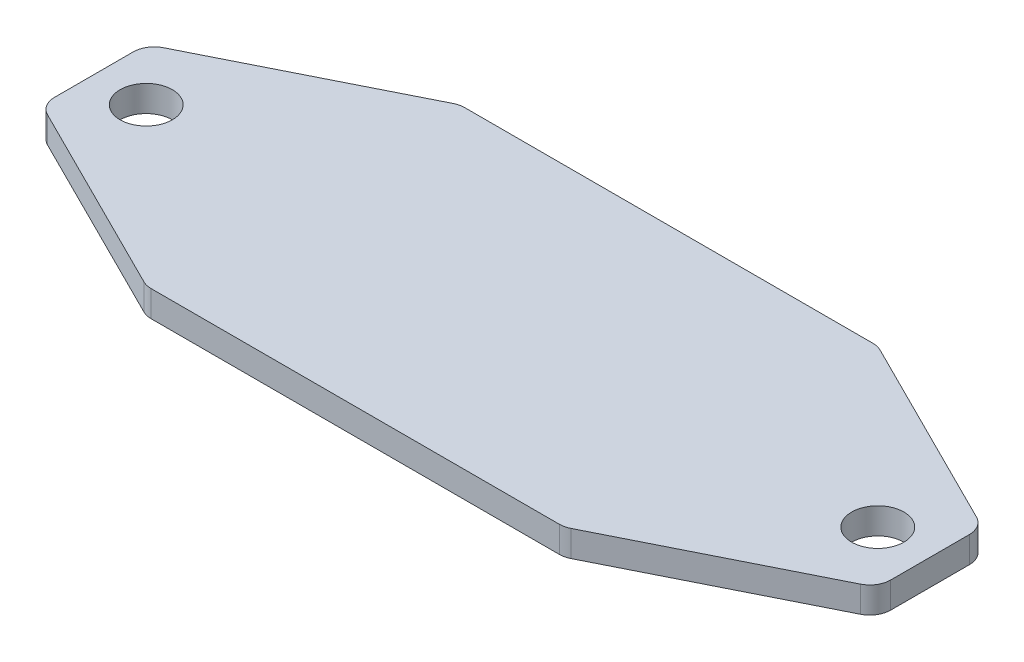
ISO-10303-21;
HEADER;
FILE_DESCRIPTION(('STEP AP214'),'2;1');
FILE_NAME('part.step','',(''),(''),'','','');
FILE_SCHEMA(('AUTOMOTIVE_DESIGN { 1 0 10303 214 1 1 1 1 }'));
ENDSEC;
DATA;
#1=APPLICATION_CONTEXT('core data for automotive mechanical design processes');
#2=APPLICATION_PROTOCOL_DEFINITION('international standard','automotive_design',2000,#1);
#3=PRODUCT_CONTEXT('',#1,'mechanical');
#4=PRODUCT('Part','Part','',(#3));
#5=PRODUCT_RELATED_PRODUCT_CATEGORY('part','',(#4));
#6=PRODUCT_DEFINITION_FORMATION('','',#4);
#7=PRODUCT_DEFINITION_CONTEXT('part definition',#1,'design');
#8=PRODUCT_DEFINITION('design','',#6,#7);
#9=PRODUCT_DEFINITION_SHAPE('','',#8);
#10=(LENGTH_UNIT() NAMED_UNIT(*) SI_UNIT(.MILLI.,.METRE.));
#11=(NAMED_UNIT(*) PLANE_ANGLE_UNIT() SI_UNIT($,.RADIAN.));
#12=(NAMED_UNIT(*) SI_UNIT($,.STERADIAN.) SOLID_ANGLE_UNIT());
#13=UNCERTAINTY_MEASURE_WITH_UNIT(LENGTH_MEASURE(1.E-05),#10,'distance_accuracy_value','');
#14=(GEOMETRIC_REPRESENTATION_CONTEXT(3) GLOBAL_UNCERTAINTY_ASSIGNED_CONTEXT((#13)) GLOBAL_UNIT_ASSIGNED_CONTEXT((#10,
#11,#12)) REPRESENTATION_CONTEXT('',''));
#15=CARTESIAN_POINT('',(0.,0.,0.));
#16=DIRECTION('',(0.,0.,1.));
#17=DIRECTION('',(1.,0.,0.));
#18=AXIS2_PLACEMENT_3D('',#15,#16,#17);
#19=CARTESIAN_POINT('',(64.6985002136231,0.,4.78019366857527));
#20=DIRECTION('',(0.,1.,0.));
#21=DIRECTION('',(0.,0.,1.));
#22=AXIS2_PLACEMENT_3D('',#19,#20,#21);
#23=CYLINDRICAL_SURFACE('',#22,2.53999999999998);
#24=CARTESIAN_POINT('',(64.6985002136231,3.175,4.78019366857527));
#25=DIRECTION('',(0.,1.,0.));
#26=DIRECTION('',(0.,0.,1.));
#27=AXIS2_PLACEMENT_3D('',#24,#25,#26);
#28=CIRCLE('',#27,2.53999999999998);
#29=CARTESIAN_POINT('',(65.8344227461929,3.175,7.05203873371506));
#30=VERTEX_POINT('',#29);
#31=CARTESIAN_POINT('',(67.2385002136231,3.175,4.78019366857527));
#32=VERTEX_POINT('',#31);
#33=EDGE_CURVE('E194',#30,#32,#28,.T.);
#34=ORIENTED_EDGE('',*,*,#33,.F.);
#35=DIRECTION('',(0.,1.,0.));
#36=VECTOR('',#35,1.);
#37=CARTESIAN_POINT('',(65.8344227461929,0.,7.05203873371506));
#38=LINE('',#37,#36);
#39=CARTESIAN_POINT('',(65.8344227461929,0.,7.05203873371506));
#40=VERTEX_POINT('',#39);
#41=EDGE_CURVE('E11',#40,#30,#38,.T.);
#42=ORIENTED_EDGE('',*,*,#41,.F.);
#43=CARTESIAN_POINT('',(64.6985002136231,0.,4.78019366857527));
#44=DIRECTION('',(0.,1.,0.));
#45=DIRECTION('',(0.,0.,1.));
#46=AXIS2_PLACEMENT_3D('',#43,#44,#45);
#47=CIRCLE('',#46,2.53999999999998);
#48=CARTESIAN_POINT('',(67.2385002136231,0.,4.78019366857527));
#49=VERTEX_POINT('',#48);
#50=EDGE_CURVE('E255',#40,#49,#47,.T.);
#51=ORIENTED_EDGE('',*,*,#50,.T.);
#52=DIRECTION('',(0.,1.,0.));
#53=VECTOR('',#52,1.);
#54=CARTESIAN_POINT('',(67.2385002136231,0.,4.78019366857527));
#55=LINE('',#54,#53);
#56=EDGE_CURVE('E46',#49,#32,#55,.T.);
#57=ORIENTED_EDGE('',*,*,#56,.T.);
#58=EDGE_LOOP('',(#34,#42,#51,#57));
#59=FACE_BOUND('',#58,.T.);
#60=ADVANCED_FACE('F43',(#59),#23,.T.);
#61=CARTESIAN_POINT('',(42.3748100833434,0.,18.7818450651398));
#62=DIRECTION('',(0.447213595499958,0.,0.894427190999916));
#63=DIRECTION('',(0.894427190999916,0.,-0.447213595499958));
#64=AXIS2_PLACEMENT_3D('',#61,#62,#63);
#65=PLANE('',#64);
#66=DIRECTION('',(0.894427190999916,0.,-0.447213595499958));
#67=VECTOR('',#66,1.);
#68=CARTESIAN_POINT('',(42.3748100833434,3.175,18.7818450651398));
#69=LINE('',#68,#67);
#70=CARTESIAN_POINT('',(42.3748100833434,3.175,18.7818450651398));
#71=VERTEX_POINT('',#70);
#72=EDGE_CURVE('E252',#71,#30,#69,.T.);
#73=ORIENTED_EDGE('',*,*,#72,.F.);
#74=DIRECTION('',(0.,1.,0.));
#75=VECTOR('',#74,1.);
#76=CARTESIAN_POINT('',(42.3748100833434,0.,18.7818450651398));
#77=LINE('',#76,#75);
#78=CARTESIAN_POINT('',(42.3748100833434,0.,18.7818450651398));
#79=VERTEX_POINT('',#78);
#80=EDGE_CURVE('E53',#79,#71,#77,.T.);
#81=ORIENTED_EDGE('',*,*,#80,.F.);
#82=DIRECTION('',(0.894427190999916,0.,-0.447213595499958));
#83=VECTOR('',#82,1.);
#84=CARTESIAN_POINT('',(42.3748100833434,0.,18.7818450651398));
#85=LINE('',#84,#83);
#86=EDGE_CURVE('E180',#79,#40,#85,.T.);
#87=ORIENTED_EDGE('',*,*,#86,.T.);
#88=ORIENTED_EDGE('',*,*,#41,.T.);
#89=EDGE_LOOP('',(#73,#81,#87,#88));
#90=FACE_BOUND('',#89,.T.);
#91=ADVANCED_FACE('F297',(#90),#65,.T.);
#92=CARTESIAN_POINT('',(41.2388875507736,0.,16.51));
#93=DIRECTION('',(0.,1.,0.));
#94=DIRECTION('',(0.,0.,1.));
#95=AXIS2_PLACEMENT_3D('',#92,#93,#94);
#96=CYLINDRICAL_SURFACE('',#95,2.54);
#97=CARTESIAN_POINT('',(41.2388875507736,3.175,16.51));
#98=DIRECTION('',(0.,1.,0.));
#99=DIRECTION('',(0.,0.,1.));
#100=AXIS2_PLACEMENT_3D('',#97,#98,#99);
#101=CIRCLE('',#100,2.54);
#102=CARTESIAN_POINT('',(41.2388875507736,3.175,19.05));
#103=VERTEX_POINT('',#102);
#104=EDGE_CURVE('E166',#103,#71,#101,.T.);
#105=ORIENTED_EDGE('',*,*,#104,.F.);
#106=DIRECTION('',(0.,1.,0.));
#107=VECTOR('',#106,1.);
#108=CARTESIAN_POINT('',(41.2388875507736,0.,19.05));
#109=LINE('',#108,#107);
#110=CARTESIAN_POINT('',(41.2388875507736,0.,19.05));
#111=VERTEX_POINT('',#110);
#112=EDGE_CURVE('E161',#111,#103,#109,.T.);
#113=ORIENTED_EDGE('',*,*,#112,.F.);
#114=CARTESIAN_POINT('',(41.2388875507736,0.,16.51));
#115=DIRECTION('',(0.,1.,0.));
#116=DIRECTION('',(0.,0.,1.));
#117=AXIS2_PLACEMENT_3D('',#114,#115,#116);
#118=CIRCLE('',#117,2.54);
#119=EDGE_CURVE('E164',#111,#79,#118,.T.);
#120=ORIENTED_EDGE('',*,*,#119,.T.);
#121=ORIENTED_EDGE('',*,*,#80,.T.);
#122=EDGE_LOOP('',(#105,#113,#120,#121));
#123=FACE_BOUND('',#122,.T.);
#124=ADVANCED_FACE('F163',(#123),#96,.T.);
#125=CARTESIAN_POINT('',(-8.36188712352748,0.,19.05));
#126=DIRECTION('',(0.,0.,1.));
#127=DIRECTION('',(1.,0.,0.));
#128=AXIS2_PLACEMENT_3D('',#125,#126,#127);
#129=PLANE('',#128);
#130=DIRECTION('',(1.,0.,0.));
#131=VECTOR('',#130,1.);
#132=CARTESIAN_POINT('',(-8.36188712352748,3.175,19.05));
#133=LINE('',#132,#131);
#134=CARTESIAN_POINT('',(-8.36188712352748,3.175,19.05));
#135=VERTEX_POINT('',#134);
#136=EDGE_CURVE('E247',#135,#103,#133,.T.);
#137=ORIENTED_EDGE('',*,*,#136,.F.);
#138=DIRECTION('',(0.,1.,0.));
#139=VECTOR('',#138,1.);
#140=CARTESIAN_POINT('',(-8.36188712352748,0.,19.05));
#141=LINE('',#140,#139);
#142=CARTESIAN_POINT('',(-8.36188712352748,0.,19.05));
#143=VERTEX_POINT('',#142);
#144=EDGE_CURVE('E172',#143,#135,#141,.T.);
#145=ORIENTED_EDGE('',*,*,#144,.F.);
#146=DIRECTION('',(1.,0.,0.));
#147=VECTOR('',#146,1.);
#148=CARTESIAN_POINT('',(-8.36188712352748,0.,19.05));
#149=LINE('',#148,#147);
#150=EDGE_CURVE('E178',#143,#111,#149,.T.);
#151=ORIENTED_EDGE('',*,*,#150,.T.);
#152=ORIENTED_EDGE('',*,*,#112,.T.);
#153=EDGE_LOOP('',(#137,#145,#151,#152));
#154=FACE_BOUND('',#153,.T.);
#155=ADVANCED_FACE('F183',(#154),#129,.T.);
#156=CARTESIAN_POINT('',(-8.36188712352748,0.,16.51));
#157=DIRECTION('',(0.,1.,0.));
#158=DIRECTION('',(0.,0.,1.));
#159=AXIS2_PLACEMENT_3D('',#156,#157,#158);
#160=CYLINDRICAL_SURFACE('',#159,2.54);
#161=CARTESIAN_POINT('',(-8.36188712352748,3.175,16.51));
#162=DIRECTION('',(0.,1.,0.));
#163=DIRECTION('',(0.,0.,1.));
#164=AXIS2_PLACEMENT_3D('',#161,#162,#163);
#165=CIRCLE('',#164,2.54);
#166=CARTESIAN_POINT('',(-9.49780965609737,3.175,18.7818450651398));
#167=VERTEX_POINT('',#166);
#168=EDGE_CURVE('E243',#167,#135,#165,.T.);
#169=ORIENTED_EDGE('',*,*,#168,.F.);
#170=DIRECTION('',(0.,1.,0.));
#171=VECTOR('',#170,1.);
#172=CARTESIAN_POINT('',(-9.49780965609737,0.,18.7818450651398));
#173=LINE('',#172,#171);
#174=CARTESIAN_POINT('',(-9.49780965609737,0.,18.7818450651398));
#175=VERTEX_POINT('',#174);
#176=EDGE_CURVE('E261',#175,#167,#173,.T.);
#177=ORIENTED_EDGE('',*,*,#176,.F.);
#178=CARTESIAN_POINT('',(-8.36188712352748,0.,16.51));
#179=DIRECTION('',(0.,1.,0.));
#180=DIRECTION('',(0.,0.,1.));
#181=AXIS2_PLACEMENT_3D('',#178,#179,#180);
#182=CIRCLE('',#181,2.54);
#183=EDGE_CURVE('E185',#175,#143,#182,.T.);
#184=ORIENTED_EDGE('',*,*,#183,.T.);
#185=ORIENTED_EDGE('',*,*,#144,.T.);
#186=EDGE_LOOP('',(#169,#177,#184,#185));
#187=FACE_BOUND('',#186,.T.);
#188=ADVANCED_FACE('F310',(#187),#160,.T.);
#189=CARTESIAN_POINT('',(-32.9574223189468,0.,7.05203873371506));
#190=DIRECTION('',(-0.447213595499958,0.,0.894427190999916));
#191=DIRECTION('',(0.894427190999916,0.,0.447213595499958));
#192=AXIS2_PLACEMENT_3D('',#189,#190,#191);
#193=PLANE('',#192);
#194=DIRECTION('',(0.894427190999916,0.,0.447213595499958));
#195=VECTOR('',#194,1.);
#196=CARTESIAN_POINT('',(-32.9574223189468,3.175,7.05203873371506));
#197=LINE('',#196,#195);
#198=CARTESIAN_POINT('',(-32.9574223189468,3.175,7.05203873371506));
#199=VERTEX_POINT('',#198);
#200=EDGE_CURVE('E239',#199,#167,#197,.T.);
#201=ORIENTED_EDGE('',*,*,#200,.F.);
#202=DIRECTION('',(0.,1.,0.));
#203=VECTOR('',#202,1.);
#204=CARTESIAN_POINT('',(-32.9574223189468,0.,7.05203873371506));
#205=LINE('',#204,#203);
#206=CARTESIAN_POINT('',(-32.9574223189468,0.,7.05203873371506));
#207=VERTEX_POINT('',#206);
#208=EDGE_CURVE('E264',#207,#199,#205,.T.);
#209=ORIENTED_EDGE('',*,*,#208,.F.);
#210=DIRECTION('',(0.894427190999916,0.,0.447213595499958));
#211=VECTOR('',#210,1.);
#212=CARTESIAN_POINT('',(-32.9574223189468,0.,7.05203873371506));
#213=LINE('',#212,#211);
#214=EDGE_CURVE('E188',#207,#175,#213,.T.);
#215=ORIENTED_EDGE('',*,*,#214,.T.);
#216=ORIENTED_EDGE('',*,*,#176,.T.);
#217=EDGE_LOOP('',(#201,#209,#215,#216));
#218=FACE_BOUND('',#217,.T.);
#219=ADVANCED_FACE('F313',(#218),#193,.T.);
#220=CARTESIAN_POINT('',(-31.8214997863769,0.,4.78019366857528));
#221=DIRECTION('',(0.,1.,0.));
#222=DIRECTION('',(0.,0.,1.));
#223=AXIS2_PLACEMENT_3D('',#220,#221,#222);
#224=CYLINDRICAL_SURFACE('',#223,2.54);
#225=CARTESIAN_POINT('',(-31.8214997863769,3.175,4.78019366857528));
#226=DIRECTION('',(0.,1.,0.));
#227=DIRECTION('',(0.,0.,1.));
#228=AXIS2_PLACEMENT_3D('',#225,#226,#227);
#229=CIRCLE('',#228,2.54);
#230=CARTESIAN_POINT('',(-34.3614997863769,3.175,4.78019366857528));
#231=VERTEX_POINT('',#230);
#232=EDGE_CURVE('E235',#231,#199,#229,.T.);
#233=ORIENTED_EDGE('',*,*,#232,.F.);
#234=DIRECTION('',(0.,1.,0.));
#235=VECTOR('',#234,1.);
#236=CARTESIAN_POINT('',(-34.3614997863769,0.,4.78019366857528));
#237=LINE('',#236,#235);
#238=CARTESIAN_POINT('',(-34.3614997863769,0.,4.78019366857528));
#239=VERTEX_POINT('',#238);
#240=EDGE_CURVE('E267',#239,#231,#237,.T.);
#241=ORIENTED_EDGE('',*,*,#240,.F.);
#242=CARTESIAN_POINT('',(-31.8214997863769,0.,4.78019366857528));
#243=DIRECTION('',(0.,1.,0.));
#244=DIRECTION('',(0.,0.,1.));
#245=AXIS2_PLACEMENT_3D('',#242,#243,#244);
#246=CIRCLE('',#245,2.54);
#247=EDGE_CURVE('E429',#239,#207,#246,.T.);
#248=ORIENTED_EDGE('',*,*,#247,.T.);
#249=ORIENTED_EDGE('',*,*,#208,.T.);
#250=EDGE_LOOP('',(#233,#241,#248,#249));
#251=FACE_BOUND('',#250,.T.);
#252=ADVANCED_FACE('F317',(#251),#224,.T.);
#253=CARTESIAN_POINT('',(-34.3614997863769,0.,-4.78019366857527));
#254=DIRECTION('',(-1.,0.,0.));
#255=DIRECTION('',(0.,0.,1.));
#256=AXIS2_PLACEMENT_3D('',#253,#254,#255);
#257=PLANE('',#256);
#258=DIRECTION('',(0.,0.,1.));
#259=VECTOR('',#258,1.);
#260=CARTESIAN_POINT('',(-34.3614997863769,3.175,-4.78019366857527));
#261=LINE('',#260,#259);
#262=CARTESIAN_POINT('',(-34.3614997863769,3.175,-4.78019366857527));
#263=VERTEX_POINT('',#262);
#264=EDGE_CURVE('E231',#263,#231,#261,.T.);
#265=ORIENTED_EDGE('',*,*,#264,.F.);
#266=DIRECTION('',(0.,1.,0.));
#267=VECTOR('',#266,1.);
#268=CARTESIAN_POINT('',(-34.3614997863769,0.,-4.78019366857527));
#269=LINE('',#268,#267);
#270=CARTESIAN_POINT('',(-34.3614997863769,0.,-4.78019366857527));
#271=VERTEX_POINT('',#270);
#272=EDGE_CURVE('E270',#271,#263,#269,.T.);
#273=ORIENTED_EDGE('',*,*,#272,.F.);
#274=DIRECTION('',(0.,0.,1.));
#275=VECTOR('',#274,1.);
#276=CARTESIAN_POINT('',(-34.3614997863769,0.,-4.78019366857527));
#277=LINE('',#276,#275);
#278=EDGE_CURVE('E425',#271,#239,#277,.T.);
#279=ORIENTED_EDGE('',*,*,#278,.T.);
#280=ORIENTED_EDGE('',*,*,#240,.T.);
#281=EDGE_LOOP('',(#265,#273,#279,#280));
#282=FACE_BOUND('',#281,.T.);
#283=ADVANCED_FACE('F321',(#282),#257,.T.);
#284=CARTESIAN_POINT('',(-31.8214997863769,0.,-4.78019366857527));
#285=DIRECTION('',(0.,1.,0.));
#286=DIRECTION('',(0.,0.,1.));
#287=AXIS2_PLACEMENT_3D('',#284,#285,#286);
#288=CYLINDRICAL_SURFACE('',#287,2.54);
#289=CARTESIAN_POINT('',(-31.8214997863769,3.175,-4.78019366857527));
#290=DIRECTION('',(0.,1.,0.));
#291=DIRECTION('',(0.,0.,1.));
#292=AXIS2_PLACEMENT_3D('',#289,#290,#291);
#293=CIRCLE('',#292,2.54);
#294=CARTESIAN_POINT('',(-32.9574223189468,3.175,-7.05203873371505));
#295=VERTEX_POINT('',#294);
#296=EDGE_CURVE('E227',#295,#263,#293,.T.);
#297=ORIENTED_EDGE('',*,*,#296,.F.);
#298=DIRECTION('',(0.,1.,0.));
#299=VECTOR('',#298,1.);
#300=CARTESIAN_POINT('',(-32.9574223189468,0.,-7.05203873371505));
#301=LINE('',#300,#299);
#302=CARTESIAN_POINT('',(-32.9574223189468,0.,-7.05203873371505));
#303=VERTEX_POINT('',#302);
#304=EDGE_CURVE('E273',#303,#295,#301,.T.);
#305=ORIENTED_EDGE('',*,*,#304,.F.);
#306=CARTESIAN_POINT('',(-31.8214997863769,0.,-4.78019366857527));
#307=DIRECTION('',(0.,1.,0.));
#308=DIRECTION('',(0.,0.,1.));
#309=AXIS2_PLACEMENT_3D('',#306,#307,#308);
#310=CIRCLE('',#309,2.54);
#311=EDGE_CURVE('E421',#303,#271,#310,.T.);
#312=ORIENTED_EDGE('',*,*,#311,.T.);
#313=ORIENTED_EDGE('',*,*,#272,.T.);
#314=EDGE_LOOP('',(#297,#305,#312,#313));
#315=FACE_BOUND('',#314,.T.);
#316=ADVANCED_FACE('F325',(#315),#288,.T.);
#317=CARTESIAN_POINT('',(-9.49780965609738,0.,-18.7818450651398));
#318=DIRECTION('',(-0.447213595499958,0.,-0.894427190999916));
#319=DIRECTION('',(-0.894427190999916,0.,0.447213595499958));
#320=AXIS2_PLACEMENT_3D('',#317,#318,#319);
#321=PLANE('',#320);
#322=DIRECTION('',(-0.894427190999916,0.,0.447213595499958));
#323=VECTOR('',#322,1.);
#324=CARTESIAN_POINT('',(-9.49780965609738,3.175,-18.7818450651398));
#325=LINE('',#324,#323);
#326=CARTESIAN_POINT('',(-9.49780965609738,3.175,-18.7818450651398));
#327=VERTEX_POINT('',#326);
#328=EDGE_CURVE('E223',#327,#295,#325,.T.);
#329=ORIENTED_EDGE('',*,*,#328,.F.);
#330=DIRECTION('',(0.,1.,0.));
#331=VECTOR('',#330,1.);
#332=CARTESIAN_POINT('',(-9.49780965609738,0.,-18.7818450651398));
#333=LINE('',#332,#331);
#334=CARTESIAN_POINT('',(-9.49780965609738,0.,-18.7818450651398));
#335=VERTEX_POINT('',#334);
#336=EDGE_CURVE('E276',#335,#327,#333,.T.);
#337=ORIENTED_EDGE('',*,*,#336,.F.);
#338=DIRECTION('',(-0.894427190999916,0.,0.447213595499958));
#339=VECTOR('',#338,1.);
#340=CARTESIAN_POINT('',(-9.49780965609738,0.,-18.7818450651398));
#341=LINE('',#340,#339);
#342=EDGE_CURVE('E417',#335,#303,#341,.T.);
#343=ORIENTED_EDGE('',*,*,#342,.T.);
#344=ORIENTED_EDGE('',*,*,#304,.T.);
#345=EDGE_LOOP('',(#329,#337,#343,#344));
#346=FACE_BOUND('',#345,.T.);
#347=ADVANCED_FACE('F329',(#346),#321,.T.);
#348=CARTESIAN_POINT('',(-8.36188712352749,0.,-16.51));
#349=DIRECTION('',(0.,1.,0.));
#350=DIRECTION('',(0.,0.,1.));
#351=AXIS2_PLACEMENT_3D('',#348,#349,#350);
#352=CYLINDRICAL_SURFACE('',#351,2.54);
#353=CARTESIAN_POINT('',(-8.36188712352749,3.175,-16.51));
#354=DIRECTION('',(0.,1.,0.));
#355=DIRECTION('',(0.,0.,1.));
#356=AXIS2_PLACEMENT_3D('',#353,#354,#355);
#357=CIRCLE('',#356,2.54);
#358=CARTESIAN_POINT('',(-8.36188712352749,3.175,-19.05));
#359=VERTEX_POINT('',#358);
#360=EDGE_CURVE('E219',#359,#327,#357,.T.);
#361=ORIENTED_EDGE('',*,*,#360,.F.);
#362=DIRECTION('',(0.,1.,0.));
#363=VECTOR('',#362,1.);
#364=CARTESIAN_POINT('',(-8.36188712352749,0.,-19.05));
#365=LINE('',#364,#363);
#366=CARTESIAN_POINT('',(-8.36188712352749,0.,-19.05));
#367=VERTEX_POINT('',#366);
#368=EDGE_CURVE('E279',#367,#359,#365,.T.);
#369=ORIENTED_EDGE('',*,*,#368,.F.);
#370=CARTESIAN_POINT('',(-8.36188712352749,0.,-16.51));
#371=DIRECTION('',(0.,1.,0.));
#372=DIRECTION('',(0.,0.,1.));
#373=AXIS2_PLACEMENT_3D('',#370,#371,#372);
#374=CIRCLE('',#373,2.54);
#375=EDGE_CURVE('E413',#367,#335,#374,.T.);
#376=ORIENTED_EDGE('',*,*,#375,.T.);
#377=ORIENTED_EDGE('',*,*,#336,.T.);
#378=EDGE_LOOP('',(#361,#369,#376,#377));
#379=FACE_BOUND('',#378,.T.);
#380=ADVANCED_FACE('F333',(#379),#352,.T.);
#381=CARTESIAN_POINT('',(41.2388875507736,0.,-19.05));
#382=DIRECTION('',(0.,0.,-1.));
#383=DIRECTION('',(-1.,0.,0.));
#384=AXIS2_PLACEMENT_3D('',#381,#382,#383);
#385=PLANE('',#384);
#386=DIRECTION('',(-1.,0.,0.));
#387=VECTOR('',#386,1.);
#388=CARTESIAN_POINT('',(41.2388875507736,3.175,-19.05));
#389=LINE('',#388,#387);
#390=CARTESIAN_POINT('',(41.2388875507736,3.175,-19.05));
#391=VERTEX_POINT('',#390);
#392=EDGE_CURVE('E215',#391,#359,#389,.T.);
#393=ORIENTED_EDGE('',*,*,#392,.F.);
#394=DIRECTION('',(0.,1.,0.));
#395=VECTOR('',#394,1.);
#396=CARTESIAN_POINT('',(41.2388875507736,0.,-19.05));
#397=LINE('',#396,#395);
#398=CARTESIAN_POINT('',(41.2388875507736,0.,-19.05));
#399=VERTEX_POINT('',#398);
#400=EDGE_CURVE('E282',#399,#391,#397,.T.);
#401=ORIENTED_EDGE('',*,*,#400,.F.);
#402=DIRECTION('',(-1.,0.,0.));
#403=VECTOR('',#402,1.);
#404=CARTESIAN_POINT('',(41.2388875507736,0.,-19.05));
#405=LINE('',#404,#403);
#406=EDGE_CURVE('E409',#399,#367,#405,.T.);
#407=ORIENTED_EDGE('',*,*,#406,.T.);
#408=ORIENTED_EDGE('',*,*,#368,.T.);
#409=EDGE_LOOP('',(#393,#401,#407,#408));
#410=FACE_BOUND('',#409,.T.);
#411=ADVANCED_FACE('F337',(#410),#385,.T.);
#412=CARTESIAN_POINT('',(41.2388875507736,0.,-16.51));
#413=DIRECTION('',(0.,1.,0.));
#414=DIRECTION('',(0.,0.,1.));
#415=AXIS2_PLACEMENT_3D('',#412,#413,#414);
#416=CYLINDRICAL_SURFACE('',#415,2.54000000000001);
#417=CARTESIAN_POINT('',(41.2388875507736,3.175,-16.51));
#418=DIRECTION('',(0.,1.,0.));
#419=DIRECTION('',(0.,0.,1.));
#420=AXIS2_PLACEMENT_3D('',#417,#418,#419);
#421=CIRCLE('',#420,2.54000000000001);
#422=CARTESIAN_POINT('',(42.3748100833435,3.175,-18.7818450651398));
#423=VERTEX_POINT('',#422);
#424=EDGE_CURVE('E211',#423,#391,#421,.T.);
#425=ORIENTED_EDGE('',*,*,#424,.F.);
#426=DIRECTION('',(0.,1.,0.));
#427=VECTOR('',#426,1.);
#428=CARTESIAN_POINT('',(42.3748100833435,0.,-18.7818450651398));
#429=LINE('',#428,#427);
#430=CARTESIAN_POINT('',(42.3748100833435,0.,-18.7818450651398));
#431=VERTEX_POINT('',#430);
#432=EDGE_CURVE('E285',#431,#423,#429,.T.);
#433=ORIENTED_EDGE('',*,*,#432,.F.);
#434=CARTESIAN_POINT('',(41.2388875507736,0.,-16.51));
#435=DIRECTION('',(0.,1.,0.));
#436=DIRECTION('',(0.,0.,1.));
#437=AXIS2_PLACEMENT_3D('',#434,#435,#436);
#438=CIRCLE('',#437,2.54000000000001);
#439=EDGE_CURVE('E405',#431,#399,#438,.T.);
#440=ORIENTED_EDGE('',*,*,#439,.T.);
#441=ORIENTED_EDGE('',*,*,#400,.T.);
#442=EDGE_LOOP('',(#425,#433,#440,#441));
#443=FACE_BOUND('',#442,.T.);
#444=ADVANCED_FACE('F341',(#443),#416,.T.);
#445=CARTESIAN_POINT('',(65.8344227461929,0.,-7.05203873371506));
#446=DIRECTION('',(0.447213595499959,0.,-0.894427190999915));
#447=DIRECTION('',(-0.894427190999915,0.,-0.447213595499959));
#448=AXIS2_PLACEMENT_3D('',#445,#446,#447);
#449=PLANE('',#448);
#450=DIRECTION('',(-0.894427190999915,0.,-0.447213595499959));
#451=VECTOR('',#450,1.);
#452=CARTESIAN_POINT('',(65.8344227461929,3.175,-7.05203873371506));
#453=LINE('',#452,#451);
#454=CARTESIAN_POINT('',(65.8344227461929,3.175,-7.05203873371507));
#455=VERTEX_POINT('',#454);
#456=EDGE_CURVE('E207',#455,#423,#453,.T.);
#457=ORIENTED_EDGE('',*,*,#456,.F.);
#458=DIRECTION('',(0.,1.,0.));
#459=VECTOR('',#458,1.);
#460=CARTESIAN_POINT('',(65.8344227461929,0.,-7.05203873371507));
#461=LINE('',#460,#459);
#462=CARTESIAN_POINT('',(65.8344227461929,0.,-7.05203873371507));
#463=VERTEX_POINT('',#462);
#464=EDGE_CURVE('E288',#463,#455,#461,.T.);
#465=ORIENTED_EDGE('',*,*,#464,.F.);
#466=DIRECTION('',(-0.894427190999915,0.,-0.447213595499959));
#467=VECTOR('',#466,1.);
#468=CARTESIAN_POINT('',(65.8344227461929,0.,-7.05203873371506));
#469=LINE('',#468,#467);
#470=EDGE_CURVE('E401',#463,#431,#469,.T.);
#471=ORIENTED_EDGE('',*,*,#470,.T.);
#472=ORIENTED_EDGE('',*,*,#432,.T.);
#473=EDGE_LOOP('',(#457,#465,#471,#472));
#474=FACE_BOUND('',#473,.T.);
#475=ADVANCED_FACE('F345',(#474),#449,.T.);
#476=CARTESIAN_POINT('',(64.6985002136231,0.,-4.78019366857527));
#477=DIRECTION('',(0.,1.,0.));
#478=DIRECTION('',(0.,0.,1.));
#479=AXIS2_PLACEMENT_3D('',#476,#477,#478);
#480=CYLINDRICAL_SURFACE('',#479,2.53999999999998);
#481=CARTESIAN_POINT('',(64.6985002136231,3.175,-4.78019366857527));
#482=DIRECTION('',(0.,1.,0.));
#483=DIRECTION('',(0.,0.,1.));
#484=AXIS2_PLACEMENT_3D('',#481,#482,#483);
#485=CIRCLE('',#484,2.53999999999998);
#486=CARTESIAN_POINT('',(67.2385002136231,3.175,-4.78019366857527));
#487=VERTEX_POINT('',#486);
#488=EDGE_CURVE('E203',#487,#455,#485,.T.);
#489=ORIENTED_EDGE('',*,*,#488,.F.);
#490=DIRECTION('',(0.,1.,0.));
#491=VECTOR('',#490,1.);
#492=CARTESIAN_POINT('',(67.2385002136231,0.,-4.78019366857527));
#493=LINE('',#492,#491);
#494=CARTESIAN_POINT('',(67.2385002136231,0.,-4.78019366857527));
#495=VERTEX_POINT('',#494);
#496=EDGE_CURVE('E290',#495,#487,#493,.T.);
#497=ORIENTED_EDGE('',*,*,#496,.F.);
#498=CARTESIAN_POINT('',(64.6985002136231,0.,-4.78019366857527));
#499=DIRECTION('',(0.,1.,0.));
#500=DIRECTION('',(0.,0.,1.));
#501=AXIS2_PLACEMENT_3D('',#498,#499,#500);
#502=CIRCLE('',#501,2.53999999999998);
#503=EDGE_CURVE('E397',#495,#463,#502,.T.);
#504=ORIENTED_EDGE('',*,*,#503,.T.);
#505=ORIENTED_EDGE('',*,*,#464,.T.);
#506=EDGE_LOOP('',(#489,#497,#504,#505));
#507=FACE_BOUND('',#506,.T.);
#508=ADVANCED_FACE('F349',(#507),#480,.T.);
#509=CARTESIAN_POINT('',(67.2385002136231,0.,4.78019366857527));
#510=DIRECTION('',(1.,0.,0.));
#511=DIRECTION('',(0.,0.,-1.));
#512=AXIS2_PLACEMENT_3D('',#509,#510,#511);
#513=PLANE('',#512);
#514=DIRECTION('',(0.,0.,-1.));
#515=VECTOR('',#514,1.);
#516=CARTESIAN_POINT('',(67.2385002136231,3.175,4.78019366857527));
#517=LINE('',#516,#515);
#518=EDGE_CURVE('E198',#32,#487,#517,.T.);
#519=ORIENTED_EDGE('',*,*,#518,.F.);
#520=ORIENTED_EDGE('',*,*,#56,.F.);
#521=DIRECTION('',(0.,0.,-1.));
#522=VECTOR('',#521,1.);
#523=CARTESIAN_POINT('',(67.2385002136231,0.,4.78019366857527));
#524=LINE('',#523,#522);
#525=EDGE_CURVE('E394',#49,#495,#524,.T.);
#526=ORIENTED_EDGE('',*,*,#525,.T.);
#527=ORIENTED_EDGE('',*,*,#496,.T.);
#528=EDGE_LOOP('',(#519,#520,#526,#527));
#529=FACE_BOUND('',#528,.T.);
#530=ADVANCED_FACE('F294',(#529),#513,.T.);
#531=CARTESIAN_POINT('',(64.6985002136231,0.,4.78019366857527));
#532=DIRECTION('',(0.,1.,0.));
#533=DIRECTION('',(0.,0.,1.));
#534=AXIS2_PLACEMENT_3D('',#531,#532,#533);
#535=PLANE('',#534);
#536=CARTESIAN_POINT('',(60.8885002136231,0.,0.));
#537=DIRECTION('',(0.,1.,0.));
#538=DIRECTION('',(0.,0.,-1.));
#539=AXIS2_PLACEMENT_3D('',#536,#537,#538);
#540=CIRCLE('',#539,3.175);
#541=CARTESIAN_POINT('',(60.8885002136231,0.,-3.175));
#542=VERTEX_POINT('',#541);
#543=EDGE_CURVE('E376',#542,#542,#540,.T.);
#544=ORIENTED_EDGE('',*,*,#543,.T.);
#545=EDGE_LOOP('',(#544));
#546=FACE_BOUND('',#545,.T.);
#547=CARTESIAN_POINT('',(-28.011499786377,0.,0.));
#548=DIRECTION('',(0.,1.,0.));
#549=DIRECTION('',(0.,0.,-1.));
#550=AXIS2_PLACEMENT_3D('',#547,#548,#549);
#551=CIRCLE('',#550,3.175);
#552=CARTESIAN_POINT('',(-28.011499786377,0.,-3.175));
#553=VERTEX_POINT('',#552);
#554=EDGE_CURVE('E199',#553,#553,#551,.T.);
#555=ORIENTED_EDGE('',*,*,#554,.T.);
#556=EDGE_LOOP('',(#555));
#557=FACE_BOUND('',#556,.T.);
#558=ORIENTED_EDGE('',*,*,#50,.F.);
#559=ORIENTED_EDGE('',*,*,#86,.F.);
#560=ORIENTED_EDGE('',*,*,#119,.F.);
#561=ORIENTED_EDGE('',*,*,#150,.F.);
#562=ORIENTED_EDGE('',*,*,#183,.F.);
#563=ORIENTED_EDGE('',*,*,#214,.F.);
#564=ORIENTED_EDGE('',*,*,#247,.F.);
#565=ORIENTED_EDGE('',*,*,#278,.F.);
#566=ORIENTED_EDGE('',*,*,#311,.F.);
#567=ORIENTED_EDGE('',*,*,#342,.F.);
#568=ORIENTED_EDGE('',*,*,#375,.F.);
#569=ORIENTED_EDGE('',*,*,#406,.F.);
#570=ORIENTED_EDGE('',*,*,#439,.F.);
#571=ORIENTED_EDGE('',*,*,#470,.F.);
#572=ORIENTED_EDGE('',*,*,#503,.F.);
#573=ORIENTED_EDGE('',*,*,#525,.F.);
#574=EDGE_LOOP('',(#558,#559,#560,#561,#562,#563,#564,#565,#566,#567,#568,#569,#570,#571,#572,#573));
#575=FACE_BOUND('',#574,.T.);
#576=ADVANCED_FACE('F176',(#546,#557,#575),#535,.F.);
#577=CARTESIAN_POINT('',(64.6985002136231,3.175,4.78019366857527));
#578=DIRECTION('',(0.,1.,0.));
#579=DIRECTION('',(0.,0.,1.));
#580=AXIS2_PLACEMENT_3D('',#577,#578,#579);
#581=PLANE('',#580);
#582=CARTESIAN_POINT('',(60.8885002136231,3.175,0.));
#583=DIRECTION('',(0.,1.,0.));
#584=DIRECTION('',(0.,0.,-1.));
#585=AXIS2_PLACEMENT_3D('',#582,#583,#584);
#586=CIRCLE('',#585,3.175);
#587=CARTESIAN_POINT('',(60.8885002136231,3.175,-3.175));
#588=VERTEX_POINT('',#587);
#589=EDGE_CURVE('E379',#588,#588,#586,.T.);
#590=ORIENTED_EDGE('',*,*,#589,.F.);
#591=EDGE_LOOP('',(#590));
#592=FACE_BOUND('',#591,.T.);
#593=CARTESIAN_POINT('',(-28.011499786377,3.175,0.));
#594=DIRECTION('',(0.,1.,0.));
#595=DIRECTION('',(0.,0.,-1.));
#596=AXIS2_PLACEMENT_3D('',#593,#594,#595);
#597=CIRCLE('',#596,3.175);
#598=CARTESIAN_POINT('',(-28.011499786377,3.175,-3.175));
#599=VERTEX_POINT('',#598);
#600=EDGE_CURVE('E383',#599,#599,#597,.T.);
#601=ORIENTED_EDGE('',*,*,#600,.F.);
#602=EDGE_LOOP('',(#601));
#603=FACE_BOUND('',#602,.T.);
#604=ORIENTED_EDGE('',*,*,#33,.T.);
#605=ORIENTED_EDGE('',*,*,#518,.T.);
#606=ORIENTED_EDGE('',*,*,#488,.T.);
#607=ORIENTED_EDGE('',*,*,#456,.T.);
#608=ORIENTED_EDGE('',*,*,#424,.T.);
#609=ORIENTED_EDGE('',*,*,#392,.T.);
#610=ORIENTED_EDGE('',*,*,#360,.T.);
#611=ORIENTED_EDGE('',*,*,#328,.T.);
#612=ORIENTED_EDGE('',*,*,#296,.T.);
#613=ORIENTED_EDGE('',*,*,#264,.T.);
#614=ORIENTED_EDGE('',*,*,#232,.T.);
#615=ORIENTED_EDGE('',*,*,#200,.T.);
#616=ORIENTED_EDGE('',*,*,#168,.T.);
#617=ORIENTED_EDGE('',*,*,#136,.T.);
#618=ORIENTED_EDGE('',*,*,#104,.T.);
#619=ORIENTED_EDGE('',*,*,#72,.T.);
#620=EDGE_LOOP('',(#604,#605,#606,#607,#608,#609,#610,#611,#612,#613,#614,#615,#616,#617,#618,#619));
#621=FACE_BOUND('',#620,.T.);
#622=ADVANCED_FACE('F296',(#592,#603,#621),#581,.T.);
#623=CARTESIAN_POINT('',(-28.011499786377,0.,0.));
#624=DIRECTION('',(0.,1.,0.));
#625=DIRECTION('',(0.,0.,1.));
#626=AXIS2_PLACEMENT_3D('',#623,#624,#625);
#627=CYLINDRICAL_SURFACE('',#626,3.175);
#628=ORIENTED_EDGE('',*,*,#554,.F.);
#629=EDGE_LOOP('',(#628));
#630=FACE_BOUND('',#629,.T.);
#631=ORIENTED_EDGE('',*,*,#600,.T.);
#632=EDGE_LOOP('',(#631));
#633=FACE_BOUND('',#632,.T.);
#634=ADVANCED_FACE('F361',(#630,#633),#627,.F.);
#635=CARTESIAN_POINT('',(60.8885002136231,0.,0.));
#636=DIRECTION('',(0.,1.,0.));
#637=DIRECTION('',(0.,0.,1.));
#638=AXIS2_PLACEMENT_3D('',#635,#636,#637);
#639=CYLINDRICAL_SURFACE('',#638,3.175);
#640=ORIENTED_EDGE('',*,*,#543,.F.);
#641=EDGE_LOOP('',(#640));
#642=FACE_BOUND('',#641,.T.);
#643=ORIENTED_EDGE('',*,*,#589,.T.);
#644=EDGE_LOOP('',(#643));
#645=FACE_BOUND('',#644,.T.);
#646=ADVANCED_FACE('F368',(#642,#645),#639,.F.);
#647=CLOSED_SHELL('',(#60,#91,#124,#155,#188,#219,#252,#283,#316,#347,#380,#411,#444,#475,#508,
#530,#576,#622,#634,#646));
#648=MANIFOLD_SOLID_BREP('B2',#647);
#649=ADVANCED_BREP_SHAPE_REPRESENTATION('',(#18,#648),#14);
#650=SHAPE_DEFINITION_REPRESENTATION(#9,#649);
ENDSEC;
END-ISO-10303-21;
